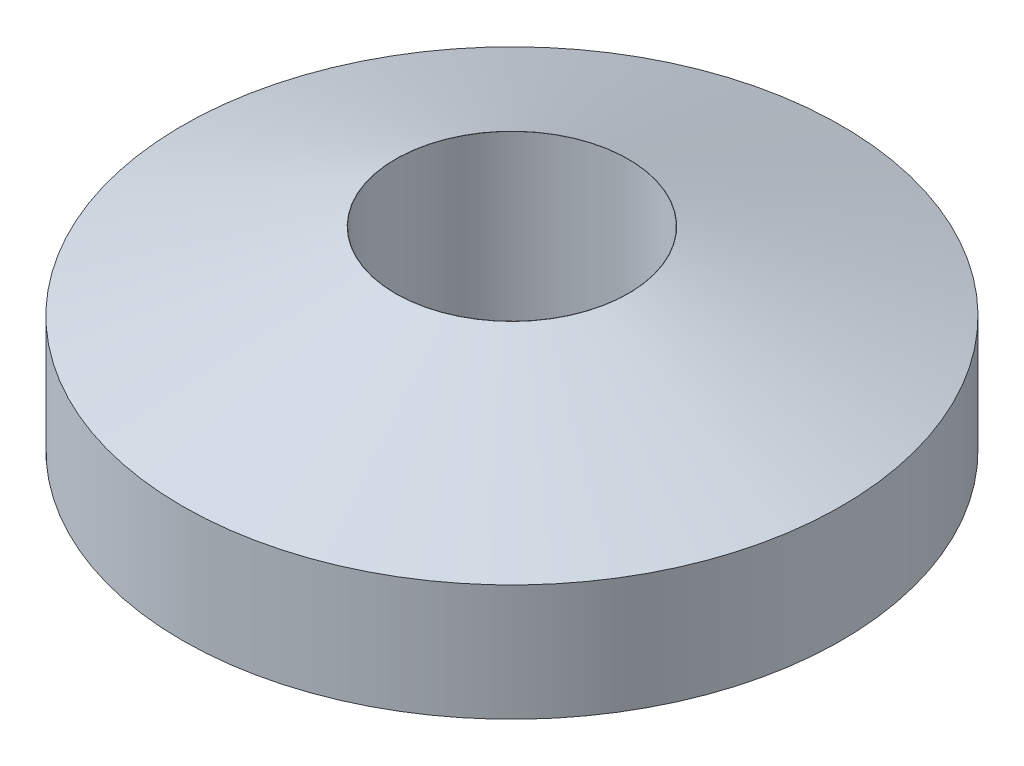
ISO-10303-21;
HEADER;
FILE_DESCRIPTION(('STEP AP214'),'2;1');
FILE_NAME('part.step','',(''),(''),'','','');
FILE_SCHEMA(('AUTOMOTIVE_DESIGN { 1 0 10303 214 1 1 1 1 }'));
ENDSEC;
DATA;
#1=APPLICATION_CONTEXT('core data for automotive mechanical design processes');
#2=APPLICATION_PROTOCOL_DEFINITION('international standard','automotive_design',2000,#1);
#3=PRODUCT_CONTEXT('',#1,'mechanical');
#4=PRODUCT('Part','Part','',(#3));
#5=PRODUCT_RELATED_PRODUCT_CATEGORY('part','',(#4));
#6=PRODUCT_DEFINITION_FORMATION('','',#4);
#7=PRODUCT_DEFINITION_CONTEXT('part definition',#1,'design');
#8=PRODUCT_DEFINITION('design','',#6,#7);
#9=PRODUCT_DEFINITION_SHAPE('','',#8);
#10=(LENGTH_UNIT() NAMED_UNIT(*) SI_UNIT(.MILLI.,.METRE.));
#11=(NAMED_UNIT(*) PLANE_ANGLE_UNIT() SI_UNIT($,.RADIAN.));
#12=(NAMED_UNIT(*) SI_UNIT($,.STERADIAN.) SOLID_ANGLE_UNIT());
#13=UNCERTAINTY_MEASURE_WITH_UNIT(LENGTH_MEASURE(1.E-05),#10,'distance_accuracy_value','');
#14=(GEOMETRIC_REPRESENTATION_CONTEXT(3) GLOBAL_UNCERTAINTY_ASSIGNED_CONTEXT((#13)) GLOBAL_UNIT_ASSIGNED_CONTEXT((#10,
#11,#12)) REPRESENTATION_CONTEXT('',''));
#15=CARTESIAN_POINT('',(0.,0.,0.));
#16=DIRECTION('',(0.,0.,1.));
#17=DIRECTION('',(1.,0.,0.));
#18=AXIS2_PLACEMENT_3D('',#15,#16,#17);
#19=CARTESIAN_POINT('',(0.,5.,0.));
#20=DIRECTION('',(0.,-1.,0.));
#21=DIRECTION('',(0.,0.,-1.));
#22=AXIS2_PLACEMENT_3D('',#19,#20,#21);
#23=CYLINDRICAL_SURFACE('',#22,8.5);
#24=CARTESIAN_POINT('',(0.,2.99999999999999,0.));
#25=DIRECTION('',(0.,1.,0.));
#26=DIRECTION('',(0.,0.,1.));
#27=AXIS2_PLACEMENT_3D('',#24,#25,#26);
#28=CIRCLE('',#27,8.5);
#29=CARTESIAN_POINT('',(0.,2.99999999999999,8.5));
#30=VERTEX_POINT('',#29);
#31=EDGE_CURVE('E10',#30,#30,#28,.F.);
#32=ORIENTED_EDGE('',*,*,#31,.T.);
#33=EDGE_LOOP('',(#32));
#34=FACE_BOUND('',#33,.T.);
#35=CARTESIAN_POINT('',(0.,0.,0.));
#36=DIRECTION('',(0.,1.,0.));
#37=DIRECTION('',(0.,0.,1.));
#38=AXIS2_PLACEMENT_3D('',#35,#36,#37);
#39=CIRCLE('',#38,8.5);
#40=CARTESIAN_POINT('',(0.,0.,8.5));
#41=VERTEX_POINT('',#40);
#42=EDGE_CURVE('E48',#41,#41,#39,.T.);
#43=ORIENTED_EDGE('',*,*,#42,.T.);
#44=EDGE_LOOP('',(#43));
#45=FACE_BOUND('',#44,.T.);
#46=ADVANCED_FACE('F36',(#34,#45),#23,.T.);
#47=CARTESIAN_POINT('',(0.,5.,0.));
#48=DIRECTION('',(0.,1.,0.));
#49=DIRECTION('',(0.,0.,1.));
#50=AXIS2_PLACEMENT_3D('',#47,#48,#49);
#51=PLANE('',#50);
#52=CARTESIAN_POINT('',(0.,5.,0.));
#53=DIRECTION('',(0.,1.,0.));
#54=DIRECTION('',(0.,0.,1.));
#55=AXIS2_PLACEMENT_3D('',#52,#53,#54);
#56=CIRCLE('',#55,3.00504516109076);
#57=CARTESIAN_POINT('',(0.,5.,3.00504516109076));
#58=VERTEX_POINT('',#57);
#59=EDGE_CURVE('E44',#58,#58,#56,.T.);
#60=ORIENTED_EDGE('',*,*,#59,.T.);
#61=EDGE_LOOP('',(#60));
#62=FACE_BOUND('',#61,.T.);
#63=CARTESIAN_POINT('',(0.,5.,0.));
#64=DIRECTION('',(0.,1.,0.));
#65=DIRECTION('',(0.,0.,1.));
#66=AXIS2_PLACEMENT_3D('',#63,#64,#65);
#67=CIRCLE('',#66,3.);
#68=CARTESIAN_POINT('',(0.,5.,3.));
#69=VERTEX_POINT('',#68);
#70=EDGE_CURVE('E56',#69,#69,#67,.T.);
#71=ORIENTED_EDGE('',*,*,#70,.F.);
#72=EDGE_LOOP('',(#71));
#73=FACE_BOUND('',#72,.T.);
#74=ADVANCED_FACE('F64',(#62,#73),#51,.T.);
#75=CARTESIAN_POINT('',(0.,0.,0.));
#76=DIRECTION('',(0.,1.,0.));
#77=DIRECTION('',(0.,0.,1.));
#78=AXIS2_PLACEMENT_3D('',#75,#76,#77);
#79=PLANE('',#78);
#80=CARTESIAN_POINT('',(0.,0.,0.));
#81=DIRECTION('',(0.,1.,0.));
#82=DIRECTION('',(0.,0.,1.));
#83=AXIS2_PLACEMENT_3D('',#80,#81,#82);
#84=CIRCLE('',#83,3.);
#85=CARTESIAN_POINT('',(0.,0.,3.));
#86=VERTEX_POINT('',#85);
#87=EDGE_CURVE('E52',#86,#86,#84,.T.);
#88=ORIENTED_EDGE('',*,*,#87,.T.);
#89=EDGE_LOOP('',(#88));
#90=FACE_BOUND('',#89,.T.);
#91=ORIENTED_EDGE('',*,*,#42,.F.);
#92=EDGE_LOOP('',(#91));
#93=FACE_BOUND('',#92,.T.);
#94=ADVANCED_FACE('F66',(#90,#93),#79,.F.);
#95=CARTESIAN_POINT('',(0.,-10.,0.));
#96=DIRECTION('',(0.,1.,0.));
#97=DIRECTION('',(0.,0.,1.));
#98=AXIS2_PLACEMENT_3D('',#95,#96,#97);
#99=CYLINDRICAL_SURFACE('',#98,3.);
#100=ORIENTED_EDGE('',*,*,#70,.T.);
#101=EDGE_LOOP('',(#100));
#102=FACE_BOUND('',#101,.T.);
#103=ORIENTED_EDGE('',*,*,#87,.F.);
#104=EDGE_LOOP('',(#103));
#105=FACE_BOUND('',#104,.T.);
#106=ADVANCED_FACE('F61',(#102,#105),#99,.F.);
#107=CARTESIAN_POINT('',(0.,5.,0.));
#108=DIRECTION('',(0.,-1.,0.));
#109=DIRECTION('',(0.,0.,-1.));
#110=AXIS2_PLACEMENT_3D('',#107,#108,#109);
#111=CONICAL_SURFACE('',#110,3.00504516109076,1.22173047639603);
#112=ORIENTED_EDGE('',*,*,#31,.F.);
#113=EDGE_LOOP('',(#112));
#114=FACE_BOUND('',#113,.T.);
#115=ORIENTED_EDGE('',*,*,#59,.F.);
#116=EDGE_LOOP('',(#115));
#117=FACE_BOUND('',#116,.T.);
#118=ADVANCED_FACE('F39',(#114,#117),#111,.T.);
#119=CLOSED_SHELL('',(#46,#74,#94,#106,#118));
#120=MANIFOLD_SOLID_BREP('B2',#119);
#121=ADVANCED_BREP_SHAPE_REPRESENTATION('',(#18,#120),#14);
#122=SHAPE_DEFINITION_REPRESENTATION(#9,#121);
ENDSEC;
END-ISO-10303-21;
